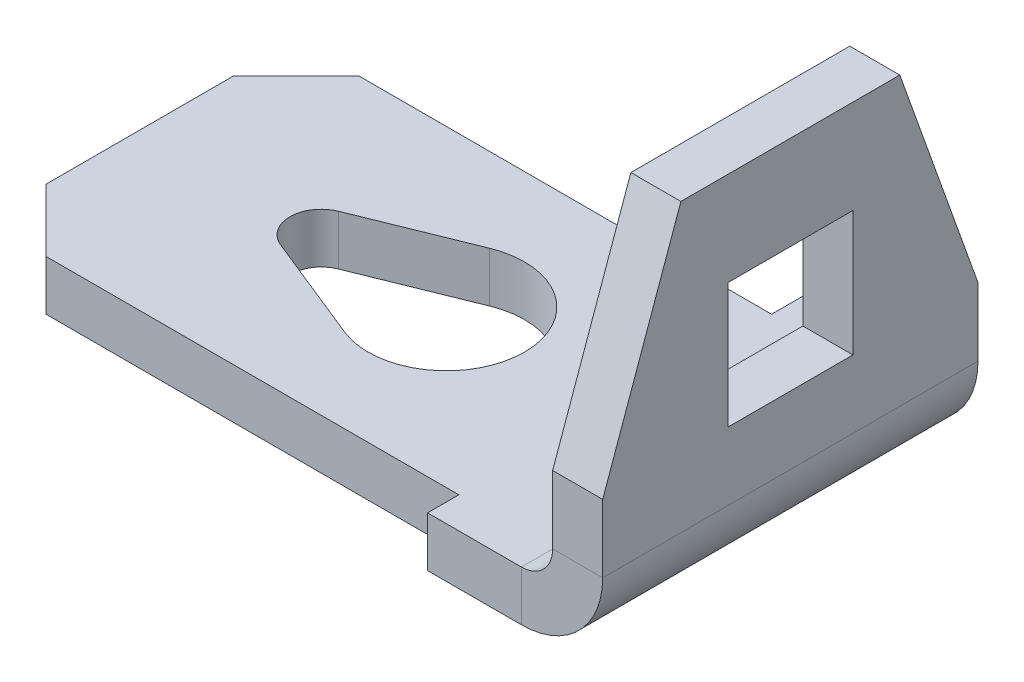
ISO-10303-21;
HEADER;
FILE_DESCRIPTION(('STEP AP214'),'2;1');
FILE_NAME('part.step','',(''),(''),'','','');
FILE_SCHEMA(('AUTOMOTIVE_DESIGN { 1 0 10303 214 1 1 1 1 }'));
ENDSEC;
DATA;
#1=APPLICATION_CONTEXT('core data for automotive mechanical design processes');
#2=APPLICATION_PROTOCOL_DEFINITION('international standard','automotive_design',2000,#1);
#3=PRODUCT_CONTEXT('',#1,'mechanical');
#4=PRODUCT('Part','Part','',(#3));
#5=PRODUCT_RELATED_PRODUCT_CATEGORY('part','',(#4));
#6=PRODUCT_DEFINITION_FORMATION('','',#4);
#7=PRODUCT_DEFINITION_CONTEXT('part definition',#1,'design');
#8=PRODUCT_DEFINITION('design','',#6,#7);
#9=PRODUCT_DEFINITION_SHAPE('','',#8);
#10=(LENGTH_UNIT() NAMED_UNIT(*) SI_UNIT(.MILLI.,.METRE.));
#11=(NAMED_UNIT(*) PLANE_ANGLE_UNIT() SI_UNIT($,.RADIAN.));
#12=(NAMED_UNIT(*) SI_UNIT($,.STERADIAN.) SOLID_ANGLE_UNIT());
#13=UNCERTAINTY_MEASURE_WITH_UNIT(LENGTH_MEASURE(1.E-05),#10,'distance_accuracy_value','');
#14=(GEOMETRIC_REPRESENTATION_CONTEXT(3) GLOBAL_UNCERTAINTY_ASSIGNED_CONTEXT((#13)) GLOBAL_UNIT_ASSIGNED_CONTEXT((#10,
#11,#12)) REPRESENTATION_CONTEXT('',''));
#15=CARTESIAN_POINT('',(0.,0.,0.));
#16=DIRECTION('',(0.,0.,1.));
#17=DIRECTION('',(1.,0.,0.));
#18=AXIS2_PLACEMENT_3D('',#15,#16,#17);
#19=CARTESIAN_POINT('',(-2.2,2.58628330588459,0.));
#20=DIRECTION('',(-1.,0.,0.));
#21=DIRECTION('',(0.,0.,1.));
#22=AXIS2_PLACEMENT_3D('',#19,#20,#21);
#23=PLANE('',#22);
#24=DIRECTION('',(0.,1.,0.));
#25=VECTOR('',#24,1.);
#26=CARTESIAN_POINT('',(-2.2,1.58628330588459,1.));
#27=LINE('',#26,#25);
#28=CARTESIAN_POINT('',(-2.2,1.58628330588459,1.));
#29=VERTEX_POINT('',#28);
#30=CARTESIAN_POINT('',(-2.20000000000001,3.58628330588459,1.));
#31=VERTEX_POINT('',#30);
#32=EDGE_CURVE('E275',#29,#31,#27,.T.);
#33=ORIENTED_EDGE('',*,*,#32,.T.);
#34=DIRECTION('',(0.,0.,-1.));
#35=VECTOR('',#34,1.);
#36=CARTESIAN_POINT('',(-2.20000000000001,3.58628330588459,1.));
#37=LINE('',#36,#35);
#38=CARTESIAN_POINT('',(-2.20000000000001,3.58628330588459,-1.));
#39=VERTEX_POINT('',#38);
#40=EDGE_CURVE('E284',#31,#39,#37,.T.);
#41=ORIENTED_EDGE('',*,*,#40,.T.);
#42=DIRECTION('',(0.,-1.,0.));
#43=VECTOR('',#42,1.);
#44=CARTESIAN_POINT('',(-2.2,1.58628330588459,-1.));
#45=LINE('',#44,#43);
#46=CARTESIAN_POINT('',(-2.2,1.58628330588459,-1.));
#47=VERTEX_POINT('',#46);
#48=EDGE_CURVE('E297',#39,#47,#45,.T.);
#49=ORIENTED_EDGE('',*,*,#48,.T.);
#50=DIRECTION('',(0.,0.,1.));
#51=VECTOR('',#50,1.);
#52=CARTESIAN_POINT('',(-2.2,1.58628330588459,1.));
#53=LINE('',#52,#51);
#54=EDGE_CURVE('E66',#47,#29,#53,.T.);
#55=ORIENTED_EDGE('',*,*,#54,.T.);
#56=EDGE_LOOP('',(#33,#41,#49,#55));
#57=FACE_BOUND('',#56,.T.);
#58=DIRECTION('',(0.,1.,0.));
#59=VECTOR('',#58,1.);
#60=CARTESIAN_POINT('',(-2.2,1.58628330588459,3.));
#61=LINE('',#60,#59);
#62=CARTESIAN_POINT('',(-2.2,0.500000000000005,3.));
#63=VERTEX_POINT('',#62);
#64=CARTESIAN_POINT('',(-2.2,1.58628330588459,3.));
#65=VERTEX_POINT('',#64);
#66=EDGE_CURVE('E46',#63,#65,#61,.T.);
#67=ORIENTED_EDGE('',*,*,#66,.F.);
#68=DIRECTION('',(0.,0.,-1.));
#69=VECTOR('',#68,1.);
#70=CARTESIAN_POINT('',(-2.2,0.500000000000004,0.));
#71=LINE('',#70,#69);
#72=CARTESIAN_POINT('',(-2.2,0.500000000000004,-3.));
#73=VERTEX_POINT('',#72);
#74=EDGE_CURVE('E203',#63,#73,#71,.T.);
#75=ORIENTED_EDGE('',*,*,#74,.T.);
#76=DIRECTION('',(0.,-1.,0.));
#77=VECTOR('',#76,1.);
#78=CARTESIAN_POINT('',(-2.2,1.58628330588459,-3.));
#79=LINE('',#78,#77);
#80=CARTESIAN_POINT('',(-2.2,1.58628330588459,-3.));
#81=VERTEX_POINT('',#80);
#82=EDGE_CURVE('E230',#81,#73,#79,.T.);
#83=ORIENTED_EDGE('',*,*,#82,.F.);
#84=DIRECTION('',(0.,-0.941741911594837,-0.336336396998156));
#85=VECTOR('',#84,1.);
#86=CARTESIAN_POINT('',(-2.20000000000001,5.08628330588459,-1.75));
#87=LINE('',#86,#85);
#88=CARTESIAN_POINT('',(-2.20000000000001,5.08628330588459,-1.75));
#89=VERTEX_POINT('',#88);
#90=EDGE_CURVE('E240',#89,#81,#87,.T.);
#91=ORIENTED_EDGE('',*,*,#90,.F.);
#92=DIRECTION('',(0.,0.,-1.));
#93=VECTOR('',#92,1.);
#94=CARTESIAN_POINT('',(-2.20000000000001,5.08628330588459,1.75));
#95=LINE('',#94,#93);
#96=CARTESIAN_POINT('',(-2.20000000000001,5.08628330588459,1.75));
#97=VERTEX_POINT('',#96);
#98=EDGE_CURVE('E261',#97,#89,#95,.T.);
#99=ORIENTED_EDGE('',*,*,#98,.F.);
#100=DIRECTION('',(0.,0.941741911594837,-0.336336396998156));
#101=VECTOR('',#100,1.);
#102=CARTESIAN_POINT('',(-2.20000000000001,5.08628330588459,1.75));
#103=LINE('',#102,#101);
#104=EDGE_CURVE('E226',#65,#97,#103,.T.);
#105=ORIENTED_EDGE('',*,*,#104,.F.);
#106=EDGE_LOOP('',(#67,#75,#83,#91,#99,#105));
#107=FACE_BOUND('',#106,.T.);
#108=ADVANCED_FACE('F42',(#57,#107),#23,.F.);
#109=CARTESIAN_POINT('',(-2.20000000000001,5.08628330588459,-1.75));
#110=DIRECTION('',(0.,0.336336396998156,-0.941741911594837));
#111=DIRECTION('',(0.,-0.941741911594838,-0.336336396998156));
#112=AXIS2_PLACEMENT_3D('',#109,#110,#111);
#113=PLANE('',#112);
#114=DIRECTION('',(0.,-0.941741911594837,-0.336336396998156));
#115=VECTOR('',#114,1.);
#116=CARTESIAN_POINT('',(-3.00000000000001,5.08628330588459,-1.75));
#117=LINE('',#116,#115);
#118=CARTESIAN_POINT('',(-3.00000000000001,5.08628330588459,-1.75));
#119=VERTEX_POINT('',#118);
#120=CARTESIAN_POINT('',(-3.,1.58628330588459,-3.));
#121=VERTEX_POINT('',#120);
#122=EDGE_CURVE('E243',#119,#121,#117,.T.);
#123=ORIENTED_EDGE('',*,*,#122,.F.);
#124=DIRECTION('',(-1.,0.,0.));
#125=VECTOR('',#124,1.);
#126=CARTESIAN_POINT('',(-2.20000000000001,5.08628330588459,-1.75));
#127=LINE('',#126,#125);
#128=EDGE_CURVE('E213',#89,#119,#127,.T.);
#129=ORIENTED_EDGE('',*,*,#128,.F.);
#130=ORIENTED_EDGE('',*,*,#90,.T.);
#131=DIRECTION('',(-1.,0.,0.));
#132=VECTOR('',#131,1.);
#133=CARTESIAN_POINT('',(-2.2,1.58628330588459,-3.));
#134=LINE('',#133,#132);
#135=EDGE_CURVE('E260',#81,#121,#134,.T.);
#136=ORIENTED_EDGE('',*,*,#135,.T.);
#137=EDGE_LOOP('',(#123,#129,#130,#136));
#138=FACE_BOUND('',#137,.T.);
#139=ADVANCED_FACE('F467',(#138),#113,.T.);
#140=CARTESIAN_POINT('',(-2.20000000000001,5.08628330588459,1.75));
#141=DIRECTION('',(0.,1.,0.));
#142=DIRECTION('',(0.,0.,-1.));
#143=AXIS2_PLACEMENT_3D('',#140,#141,#142);
#144=PLANE('',#143);
#145=DIRECTION('',(0.,0.,-1.));
#146=VECTOR('',#145,1.);
#147=CARTESIAN_POINT('',(-3.00000000000001,5.08628330588459,1.75));
#148=LINE('',#147,#146);
#149=CARTESIAN_POINT('',(-3.00000000000001,5.08628330588459,1.75));
#150=VERTEX_POINT('',#149);
#151=EDGE_CURVE('E247',#150,#119,#148,.T.);
#152=ORIENTED_EDGE('',*,*,#151,.F.);
#153=DIRECTION('',(-1.,0.,0.));
#154=VECTOR('',#153,1.);
#155=CARTESIAN_POINT('',(-2.20000000000001,5.08628330588459,1.75));
#156=LINE('',#155,#154);
#157=EDGE_CURVE('E257',#97,#150,#156,.T.);
#158=ORIENTED_EDGE('',*,*,#157,.F.);
#159=ORIENTED_EDGE('',*,*,#98,.T.);
#160=ORIENTED_EDGE('',*,*,#128,.T.);
#161=EDGE_LOOP('',(#152,#158,#159,#160));
#162=FACE_BOUND('',#161,.T.);
#163=ADVANCED_FACE('F468',(#162),#144,.T.);
#164=CARTESIAN_POINT('',(-2.20000000000001,5.08628330588459,1.75));
#165=DIRECTION('',(0.,0.336336396998156,0.941741911594837));
#166=DIRECTION('',(0.,0.941741911594838,-0.336336396998156));
#167=AXIS2_PLACEMENT_3D('',#164,#165,#166);
#168=PLANE('',#167);
#169=DIRECTION('',(0.,0.941741911594837,-0.336336396998156));
#170=VECTOR('',#169,1.);
#171=CARTESIAN_POINT('',(-3.00000000000001,5.08628330588459,1.75));
#172=LINE('',#171,#170);
#173=CARTESIAN_POINT('',(-3.,1.58628330588459,3.));
#174=VERTEX_POINT('',#173);
#175=EDGE_CURVE('E244',#174,#150,#172,.T.);
#176=ORIENTED_EDGE('',*,*,#175,.F.);
#177=DIRECTION('',(-1.,0.,0.));
#178=VECTOR('',#177,1.);
#179=CARTESIAN_POINT('',(-2.2,1.58628330588459,3.));
#180=LINE('',#179,#178);
#181=EDGE_CURVE('E259',#65,#174,#180,.T.);
#182=ORIENTED_EDGE('',*,*,#181,.F.);
#183=ORIENTED_EDGE('',*,*,#104,.T.);
#184=ORIENTED_EDGE('',*,*,#157,.T.);
#185=EDGE_LOOP('',(#176,#182,#183,#184));
#186=FACE_BOUND('',#185,.T.);
#187=ADVANCED_FACE('F505',(#186),#168,.T.);
#188=CARTESIAN_POINT('',(-2.2,1.58628330588459,3.));
#189=DIRECTION('',(0.,0.,1.));
#190=DIRECTION('',(0.,1.,0.));
#191=AXIS2_PLACEMENT_3D('',#188,#189,#190);
#192=PLANE('',#191);
#193=DIRECTION('',(-1.,0.,0.));
#194=VECTOR('',#193,1.);
#195=CARTESIAN_POINT('',(-2.2,0.500000000000004,3.));
#196=LINE('',#195,#194);
#197=CARTESIAN_POINT('',(-3.,0.500000000000002,3.));
#198=VERTEX_POINT('',#197);
#199=EDGE_CURVE('E212',#63,#198,#196,.T.);
#200=ORIENTED_EDGE('',*,*,#199,.F.);
#201=ORIENTED_EDGE('',*,*,#66,.T.);
#202=ORIENTED_EDGE('',*,*,#181,.T.);
#203=DIRECTION('',(0.,1.,0.));
#204=VECTOR('',#203,1.);
#205=CARTESIAN_POINT('',(-3.,1.58628330588459,3.));
#206=LINE('',#205,#204);
#207=EDGE_CURVE('E233',#198,#174,#206,.T.);
#208=ORIENTED_EDGE('',*,*,#207,.F.);
#209=EDGE_LOOP('',(#200,#201,#202,#208));
#210=FACE_BOUND('',#209,.T.);
#211=ADVANCED_FACE('F232',(#210),#192,.T.);
#212=CARTESIAN_POINT('',(-2.2,1.58628330588459,-3.));
#213=DIRECTION('',(0.,0.,-1.));
#214=DIRECTION('',(0.,-1.,0.));
#215=AXIS2_PLACEMENT_3D('',#212,#213,#214);
#216=PLANE('',#215);
#217=DIRECTION('',(1.,0.,0.));
#218=VECTOR('',#217,1.);
#219=CARTESIAN_POINT('',(-2.2,0.500000000000004,-3.));
#220=LINE('',#219,#218);
#221=CARTESIAN_POINT('',(-3.,0.500000000000002,-3.));
#222=VERTEX_POINT('',#221);
#223=EDGE_CURVE('E12',#222,#73,#220,.T.);
#224=ORIENTED_EDGE('',*,*,#223,.F.);
#225=DIRECTION('',(0.,-1.,0.));
#226=VECTOR('',#225,1.);
#227=CARTESIAN_POINT('',(-3.,1.58628330588459,-3.));
#228=LINE('',#227,#226);
#229=EDGE_CURVE('E241',#121,#222,#228,.T.);
#230=ORIENTED_EDGE('',*,*,#229,.F.);
#231=ORIENTED_EDGE('',*,*,#135,.F.);
#232=ORIENTED_EDGE('',*,*,#82,.T.);
#233=EDGE_LOOP('',(#224,#230,#231,#232));
#234=FACE_BOUND('',#233,.T.);
#235=ADVANCED_FACE('F44',(#234),#216,.T.);
#236=CARTESIAN_POINT('',(-3.,2.58628330588459,0.));
#237=DIRECTION('',(-1.,0.,0.));
#238=DIRECTION('',(0.,0.,1.));
#239=AXIS2_PLACEMENT_3D('',#236,#237,#238);
#240=PLANE('',#239);
#241=DIRECTION('',(0.,0.,-1.));
#242=VECTOR('',#241,1.);
#243=CARTESIAN_POINT('',(-3.,0.500000000000002,0.));
#244=LINE('',#243,#242);
#245=EDGE_CURVE('E51',#198,#222,#244,.T.);
#246=ORIENTED_EDGE('',*,*,#245,.F.);
#247=ORIENTED_EDGE('',*,*,#207,.T.);
#248=ORIENTED_EDGE('',*,*,#175,.T.);
#249=ORIENTED_EDGE('',*,*,#151,.T.);
#250=ORIENTED_EDGE('',*,*,#122,.T.);
#251=ORIENTED_EDGE('',*,*,#229,.T.);
#252=EDGE_LOOP('',(#246,#247,#248,#249,#250,#251));
#253=FACE_BOUND('',#252,.T.);
#254=DIRECTION('',(0.,0.,-1.));
#255=VECTOR('',#254,1.);
#256=CARTESIAN_POINT('',(-3.00000000000001,3.58628330588459,1.));
#257=LINE('',#256,#255);
#258=CARTESIAN_POINT('',(-3.00000000000001,3.58628330588459,1.));
#259=VERTEX_POINT('',#258);
#260=CARTESIAN_POINT('',(-3.00000000000001,3.58628330588459,-1.));
#261=VERTEX_POINT('',#260);
#262=EDGE_CURVE('E291',#259,#261,#257,.T.);
#263=ORIENTED_EDGE('',*,*,#262,.F.);
#264=DIRECTION('',(0.,1.,0.));
#265=VECTOR('',#264,1.);
#266=CARTESIAN_POINT('',(-3.,1.58628330588459,1.));
#267=LINE('',#266,#265);
#268=CARTESIAN_POINT('',(-3.,1.58628330588459,1.));
#269=VERTEX_POINT('',#268);
#270=EDGE_CURVE('E281',#269,#259,#267,.T.);
#271=ORIENTED_EDGE('',*,*,#270,.F.);
#272=DIRECTION('',(0.,0.,1.));
#273=VECTOR('',#272,1.);
#274=CARTESIAN_POINT('',(-3.,1.58628330588459,1.));
#275=LINE('',#274,#273);
#276=CARTESIAN_POINT('',(-3.,1.58628330588459,-1.));
#277=VERTEX_POINT('',#276);
#278=EDGE_CURVE('E285',#277,#269,#275,.T.);
#279=ORIENTED_EDGE('',*,*,#278,.F.);
#280=DIRECTION('',(0.,-1.,0.));
#281=VECTOR('',#280,1.);
#282=CARTESIAN_POINT('',(-3.,1.58628330588459,-1.));
#283=LINE('',#282,#281);
#284=EDGE_CURVE('E288',#261,#277,#283,.T.);
#285=ORIENTED_EDGE('',*,*,#284,.F.);
#286=EDGE_LOOP('',(#263,#271,#279,#285));
#287=FACE_BOUND('',#286,.T.);
#288=ADVANCED_FACE('F469',(#253,#287),#240,.T.);
#289=CARTESIAN_POINT('',(-2.20000000000001,3.58628330588459,1.));
#290=DIRECTION('',(0.,1.,0.));
#291=DIRECTION('',(0.,0.,-1.));
#292=AXIS2_PLACEMENT_3D('',#289,#290,#291);
#293=PLANE('',#292);
#294=ORIENTED_EDGE('',*,*,#262,.T.);
#295=DIRECTION('',(-1.,0.,0.));
#296=VECTOR('',#295,1.);
#297=CARTESIAN_POINT('',(-2.20000000000001,3.58628330588459,-1.));
#298=LINE('',#297,#296);
#299=EDGE_CURVE('E271',#39,#261,#298,.T.);
#300=ORIENTED_EDGE('',*,*,#299,.F.);
#301=ORIENTED_EDGE('',*,*,#40,.F.);
#302=DIRECTION('',(-1.,0.,0.));
#303=VECTOR('',#302,1.);
#304=CARTESIAN_POINT('',(-2.20000000000001,3.58628330588459,1.));
#305=LINE('',#304,#303);
#306=EDGE_CURVE('E279',#31,#259,#305,.T.);
#307=ORIENTED_EDGE('',*,*,#306,.T.);
#308=EDGE_LOOP('',(#294,#300,#301,#307));
#309=FACE_BOUND('',#308,.T.);
#310=ADVANCED_FACE('F472',(#309),#293,.F.);
#311=CARTESIAN_POINT('',(-2.2,1.58628330588459,1.));
#312=DIRECTION('',(0.,0.,1.));
#313=DIRECTION('',(0.,1.,0.));
#314=AXIS2_PLACEMENT_3D('',#311,#312,#313);
#315=PLANE('',#314);
#316=ORIENTED_EDGE('',*,*,#270,.T.);
#317=ORIENTED_EDGE('',*,*,#306,.F.);
#318=ORIENTED_EDGE('',*,*,#32,.F.);
#319=DIRECTION('',(-1.,0.,0.));
#320=VECTOR('',#319,1.);
#321=CARTESIAN_POINT('',(-2.2,1.58628330588459,1.));
#322=LINE('',#321,#320);
#323=EDGE_CURVE('E277',#29,#269,#322,.T.);
#324=ORIENTED_EDGE('',*,*,#323,.T.);
#325=EDGE_LOOP('',(#316,#317,#318,#324));
#326=FACE_BOUND('',#325,.T.);
#327=ADVANCED_FACE('F485',(#326),#315,.F.);
#328=CARTESIAN_POINT('',(-2.2,1.58628330588459,1.));
#329=DIRECTION('',(0.,-1.,0.));
#330=DIRECTION('',(0.,0.,1.));
#331=AXIS2_PLACEMENT_3D('',#328,#329,#330);
#332=PLANE('',#331);
#333=ORIENTED_EDGE('',*,*,#278,.T.);
#334=ORIENTED_EDGE('',*,*,#323,.F.);
#335=ORIENTED_EDGE('',*,*,#54,.F.);
#336=DIRECTION('',(-1.,0.,0.));
#337=VECTOR('',#336,1.);
#338=CARTESIAN_POINT('',(-2.2,1.58628330588459,-1.));
#339=LINE('',#338,#337);
#340=EDGE_CURVE('E274',#47,#277,#339,.T.);
#341=ORIENTED_EDGE('',*,*,#340,.T.);
#342=EDGE_LOOP('',(#333,#334,#335,#341));
#343=FACE_BOUND('',#342,.T.);
#344=ADVANCED_FACE('F486',(#343),#332,.F.);
#345=CARTESIAN_POINT('',(-2.2,1.58628330588459,-1.));
#346=DIRECTION('',(0.,0.,-1.));
#347=DIRECTION('',(0.,-1.,0.));
#348=AXIS2_PLACEMENT_3D('',#345,#346,#347);
#349=PLANE('',#348);
#350=ORIENTED_EDGE('',*,*,#284,.T.);
#351=ORIENTED_EDGE('',*,*,#340,.F.);
#352=ORIENTED_EDGE('',*,*,#48,.F.);
#353=ORIENTED_EDGE('',*,*,#299,.T.);
#354=EDGE_LOOP('',(#350,#351,#352,#353));
#355=FACE_BOUND('',#354,.T.);
#356=ADVANCED_FACE('F481',(#355),#349,.F.);
#357=CARTESIAN_POINT('',(-7.7,-0.8,0.));
#358=DIRECTION('',(0.,1.,0.));
#359=DIRECTION('',(0.,0.,1.));
#360=AXIS2_PLACEMENT_3D('',#357,#358,#359);
#361=CYLINDRICAL_SURFACE('',#360,1.25);
#362=CARTESIAN_POINT('',(-7.7,0.,0.));
#363=DIRECTION('',(0.,1.,0.));
#364=DIRECTION('',(0.,0.,1.));
#365=AXIS2_PLACEMENT_3D('',#362,#363,#364);
#366=CIRCLE('',#365,1.25);
#367=CARTESIAN_POINT('',(-8.16875,0.,1.1587810136087));
#368=VERTEX_POINT('',#367);
#369=CARTESIAN_POINT('',(-8.16875,0.,-1.1587810136087));
#370=VERTEX_POINT('',#369);
#371=EDGE_CURVE('E304',#368,#370,#366,.T.);
#372=ORIENTED_EDGE('',*,*,#371,.T.);
#373=DIRECTION('',(0.,1.,0.));
#374=VECTOR('',#373,1.);
#375=CARTESIAN_POINT('',(-8.16875,-0.8,-1.1587810136087));
#376=LINE('',#375,#374);
#377=CARTESIAN_POINT('',(-8.16875,-0.8,-1.1587810136087));
#378=VERTEX_POINT('',#377);
#379=EDGE_CURVE('E322',#378,#370,#376,.T.);
#380=ORIENTED_EDGE('',*,*,#379,.F.);
#381=CARTESIAN_POINT('',(-7.7,-0.8,0.));
#382=DIRECTION('',(0.,1.,0.));
#383=DIRECTION('',(0.,0.,1.));
#384=AXIS2_PLACEMENT_3D('',#381,#382,#383);
#385=CIRCLE('',#384,1.25);
#386=CARTESIAN_POINT('',(-8.16875,-0.8,1.1587810136087));
#387=VERTEX_POINT('',#386);
#388=EDGE_CURVE('E368',#387,#378,#385,.T.);
#389=ORIENTED_EDGE('',*,*,#388,.F.);
#390=DIRECTION('',(0.,1.,0.));
#391=VECTOR('',#390,1.);
#392=CARTESIAN_POINT('',(-8.16875,-0.8,1.1587810136087));
#393=LINE('',#392,#391);
#394=EDGE_CURVE('E307',#387,#368,#393,.T.);
#395=ORIENTED_EDGE('',*,*,#394,.T.);
#396=EDGE_LOOP('',(#372,#380,#389,#395));
#397=FACE_BOUND('',#396,.T.);
#398=ADVANCED_FACE('F493',(#397),#361,.F.);
#399=CARTESIAN_POINT('',(-9.8875,-0.8,0.463512405443479));
#400=DIRECTION('',(-0.375,0.,0.927024810886958));
#401=DIRECTION('',(0.927024810886958,0.,0.375));
#402=AXIS2_PLACEMENT_3D('',#399,#400,#401);
#403=PLANE('',#402);
#404=DIRECTION('',(0.927024810886958,0.,0.375));
#405=VECTOR('',#404,1.);
#406=CARTESIAN_POINT('',(-9.8875,0.,0.463512405443479));
#407=LINE('',#406,#405);
#408=CARTESIAN_POINT('',(-9.8875,0.,0.463512405443478));
#409=VERTEX_POINT('',#408);
#410=EDGE_CURVE('E309',#409,#368,#407,.T.);
#411=ORIENTED_EDGE('',*,*,#410,.T.);
#412=ORIENTED_EDGE('',*,*,#394,.F.);
#413=DIRECTION('',(0.927024810886958,0.,0.375));
#414=VECTOR('',#413,1.);
#415=CARTESIAN_POINT('',(-9.8875,-0.8,0.463512405443479));
#416=LINE('',#415,#414);
#417=CARTESIAN_POINT('',(-9.8875,-0.8,0.463512405443479));
#418=VERTEX_POINT('',#417);
#419=EDGE_CURVE('E365',#418,#387,#416,.T.);
#420=ORIENTED_EDGE('',*,*,#419,.F.);
#421=DIRECTION('',(0.,1.,0.));
#422=VECTOR('',#421,1.);
#423=CARTESIAN_POINT('',(-9.8875,-0.8,0.463512405443479));
#424=LINE('',#423,#422);
#425=EDGE_CURVE('E312',#418,#409,#424,.T.);
#426=ORIENTED_EDGE('',*,*,#425,.T.);
#427=EDGE_LOOP('',(#411,#412,#420,#426));
#428=FACE_BOUND('',#427,.T.);
#429=ADVANCED_FACE('F547',(#428),#403,.F.);
#430=CARTESIAN_POINT('',(-9.7,-0.8,0.));
#431=DIRECTION('',(0.,1.,0.));
#432=DIRECTION('',(0.,0.,1.));
#433=AXIS2_PLACEMENT_3D('',#430,#431,#432);
#434=CYLINDRICAL_SURFACE('',#433,0.5);
#435=CARTESIAN_POINT('',(-9.7,0.,0.));
#436=DIRECTION('',(0.,1.,0.));
#437=DIRECTION('',(0.,0.,1.));
#438=AXIS2_PLACEMENT_3D('',#435,#436,#437);
#439=CIRCLE('',#438,0.5);
#440=CARTESIAN_POINT('',(-9.8875,0.,-0.463512405443479));
#441=VERTEX_POINT('',#440);
#442=EDGE_CURVE('E315',#441,#409,#439,.T.);
#443=ORIENTED_EDGE('',*,*,#442,.T.);
#444=ORIENTED_EDGE('',*,*,#425,.F.);
#445=CARTESIAN_POINT('',(-9.7,-0.8,0.));
#446=DIRECTION('',(0.,1.,0.));
#447=DIRECTION('',(0.,0.,1.));
#448=AXIS2_PLACEMENT_3D('',#445,#446,#447);
#449=CIRCLE('',#448,0.5);
#450=CARTESIAN_POINT('',(-9.8875,-0.8,-0.463512405443479));
#451=VERTEX_POINT('',#450);
#452=EDGE_CURVE('E362',#451,#418,#449,.T.);
#453=ORIENTED_EDGE('',*,*,#452,.F.);
#454=DIRECTION('',(0.,1.,0.));
#455=VECTOR('',#454,1.);
#456=CARTESIAN_POINT('',(-9.8875,-0.8,-0.463512405443479));
#457=LINE('',#456,#455);
#458=EDGE_CURVE('E317',#451,#441,#457,.T.);
#459=ORIENTED_EDGE('',*,*,#458,.T.);
#460=EDGE_LOOP('',(#443,#444,#453,#459));
#461=FACE_BOUND('',#460,.T.);
#462=ADVANCED_FACE('F558',(#461),#434,.F.);
#463=CARTESIAN_POINT('',(-9.8875,-0.8,-0.463512405443479));
#464=DIRECTION('',(-0.375,0.,-0.927024810886958));
#465=DIRECTION('',(-0.927024810886958,0.,0.375));
#466=AXIS2_PLACEMENT_3D('',#463,#464,#465);
#467=PLANE('',#466);
#468=DIRECTION('',(-0.927024810886958,0.,0.375));
#469=VECTOR('',#468,1.);
#470=CARTESIAN_POINT('',(-9.8875,0.,-0.463512405443479));
#471=LINE('',#470,#469);
#472=EDGE_CURVE('E319',#370,#441,#471,.T.);
#473=ORIENTED_EDGE('',*,*,#472,.T.);
#474=ORIENTED_EDGE('',*,*,#458,.F.);
#475=DIRECTION('',(-0.927024810886958,0.,0.375));
#476=VECTOR('',#475,1.);
#477=CARTESIAN_POINT('',(-9.8875,-0.8,-0.463512405443479));
#478=LINE('',#477,#476);
#479=EDGE_CURVE('E359',#378,#451,#478,.T.);
#480=ORIENTED_EDGE('',*,*,#479,.F.);
#481=ORIENTED_EDGE('',*,*,#379,.T.);
#482=EDGE_LOOP('',(#473,#474,#480,#481));
#483=FACE_BOUND('',#482,.T.);
#484=ADVANCED_FACE('F569',(#483),#467,.F.);
#485=CARTESIAN_POINT('',(-5.,-0.8,-3.));
#486=DIRECTION('',(-1.,0.,0.));
#487=DIRECTION('',(0.,0.,1.));
#488=AXIS2_PLACEMENT_3D('',#485,#486,#487);
#489=PLANE('',#488);
#490=DIRECTION('',(0.,0.,1.));
#491=VECTOR('',#490,1.);
#492=CARTESIAN_POINT('',(-5.,0.,-3.));
#493=LINE('',#492,#491);
#494=CARTESIAN_POINT('',(-5.,0.,-3.));
#495=VERTEX_POINT('',#494);
#496=CARTESIAN_POINT('',(-5.,0.,-2.5));
#497=VERTEX_POINT('',#496);
#498=EDGE_CURVE('E383',#495,#497,#493,.T.);
#499=ORIENTED_EDGE('',*,*,#498,.F.);
#500=DIRECTION('',(0.,1.,0.));
#501=VECTOR('',#500,1.);
#502=CARTESIAN_POINT('',(-5.,-0.8,-3.));
#503=LINE('',#502,#501);
#504=CARTESIAN_POINT('',(-5.,-0.8,-3.));
#505=VERTEX_POINT('',#504);
#506=EDGE_CURVE('E293',#505,#495,#503,.T.);
#507=ORIENTED_EDGE('',*,*,#506,.F.);
#508=DIRECTION('',(0.,0.,1.));
#509=VECTOR('',#508,1.);
#510=CARTESIAN_POINT('',(-5.,-0.8,-3.));
#511=LINE('',#510,#509);
#512=CARTESIAN_POINT('',(-5.,-0.8,-2.5));
#513=VERTEX_POINT('',#512);
#514=EDGE_CURVE('E324',#505,#513,#511,.T.);
#515=ORIENTED_EDGE('',*,*,#514,.T.);
#516=DIRECTION('',(0.,1.,0.));
#517=VECTOR('',#516,1.);
#518=CARTESIAN_POINT('',(-5.,-0.8,-2.5));
#519=LINE('',#518,#517);
#520=EDGE_CURVE('E327',#513,#497,#519,.T.);
#521=ORIENTED_EDGE('',*,*,#520,.T.);
#522=EDGE_LOOP('',(#499,#507,#515,#521));
#523=FACE_BOUND('',#522,.T.);
#524=ADVANCED_FACE('F458',(#523),#489,.T.);
#525=CARTESIAN_POINT('',(-5.,-0.8,-2.5));
#526=DIRECTION('',(0.,0.,-1.));
#527=DIRECTION('',(-1.,0.,0.));
#528=AXIS2_PLACEMENT_3D('',#525,#526,#527);
#529=PLANE('',#528);
#530=DIRECTION('',(-1.,0.,0.));
#531=VECTOR('',#530,1.);
#532=CARTESIAN_POINT('',(-5.,0.,-2.5));
#533=LINE('',#532,#531);
#534=CARTESIAN_POINT('',(-11.6,0.,-2.5));
#535=VERTEX_POINT('',#534);
#536=EDGE_CURVE('E386',#497,#535,#533,.T.);
#537=ORIENTED_EDGE('',*,*,#536,.F.);
#538=ORIENTED_EDGE('',*,*,#520,.F.);
#539=DIRECTION('',(-1.,0.,0.));
#540=VECTOR('',#539,1.);
#541=CARTESIAN_POINT('',(-5.,-0.8,-2.5));
#542=LINE('',#541,#540);
#543=CARTESIAN_POINT('',(-11.6,-0.8,-2.5));
#544=VERTEX_POINT('',#543);
#545=EDGE_CURVE('E329',#513,#544,#542,.T.);
#546=ORIENTED_EDGE('',*,*,#545,.T.);
#547=DIRECTION('',(0.,1.,0.));
#548=VECTOR('',#547,1.);
#549=CARTESIAN_POINT('',(-11.6,-0.8,-2.5));
#550=LINE('',#549,#548);
#551=EDGE_CURVE('E332',#544,#535,#550,.T.);
#552=ORIENTED_EDGE('',*,*,#551,.T.);
#553=EDGE_LOOP('',(#537,#538,#546,#552));
#554=FACE_BOUND('',#553,.T.);
#555=ADVANCED_FACE('F453',(#554),#529,.T.);
#556=CARTESIAN_POINT('',(-11.6,-0.8,-2.5));
#557=DIRECTION('',(-0.707106781186547,0.,-0.707106781186548));
#558=DIRECTION('',(-0.707106781186548,0.,0.707106781186547));
#559=AXIS2_PLACEMENT_3D('',#556,#557,#558);
#560=PLANE('',#559);
#561=DIRECTION('',(-0.707106781186548,0.,0.707106781186547));
#562=VECTOR('',#561,1.);
#563=CARTESIAN_POINT('',(-11.6,0.,-2.5));
#564=LINE('',#563,#562);
#565=CARTESIAN_POINT('',(-12.6,0.,-1.5));
#566=VERTEX_POINT('',#565);
#567=EDGE_CURVE('E389',#535,#566,#564,.T.);
#568=ORIENTED_EDGE('',*,*,#567,.F.);
#569=ORIENTED_EDGE('',*,*,#551,.F.);
#570=DIRECTION('',(-0.707106781186548,0.,0.707106781186547));
#571=VECTOR('',#570,1.);
#572=CARTESIAN_POINT('',(-11.6,-0.8,-2.5));
#573=LINE('',#572,#571);
#574=CARTESIAN_POINT('',(-12.6,-0.8,-1.5));
#575=VERTEX_POINT('',#574);
#576=EDGE_CURVE('E334',#544,#575,#573,.T.);
#577=ORIENTED_EDGE('',*,*,#576,.T.);
#578=DIRECTION('',(0.,1.,0.));
#579=VECTOR('',#578,1.);
#580=CARTESIAN_POINT('',(-12.6,-0.8,-1.5));
#581=LINE('',#580,#579);
#582=EDGE_CURVE('E337',#575,#566,#581,.T.);
#583=ORIENTED_EDGE('',*,*,#582,.T.);
#584=EDGE_LOOP('',(#568,#569,#577,#583));
#585=FACE_BOUND('',#584,.T.);
#586=ADVANCED_FACE('F450',(#585),#560,.T.);
#587=CARTESIAN_POINT('',(-12.6,-0.8,-1.5));
#588=DIRECTION('',(-1.,0.,0.));
#589=DIRECTION('',(0.,0.,1.));
#590=AXIS2_PLACEMENT_3D('',#587,#588,#589);
#591=PLANE('',#590);
#592=DIRECTION('',(0.,0.,1.));
#593=VECTOR('',#592,1.);
#594=CARTESIAN_POINT('',(-12.6,0.,-1.5));
#595=LINE('',#594,#593);
#596=CARTESIAN_POINT('',(-12.6,0.,1.5));
#597=VERTEX_POINT('',#596);
#598=EDGE_CURVE('E392',#566,#597,#595,.T.);
#599=ORIENTED_EDGE('',*,*,#598,.F.);
#600=ORIENTED_EDGE('',*,*,#582,.F.);
#601=DIRECTION('',(0.,0.,1.));
#602=VECTOR('',#601,1.);
#603=CARTESIAN_POINT('',(-12.6,-0.8,-1.5));
#604=LINE('',#603,#602);
#605=CARTESIAN_POINT('',(-12.6,-0.8,1.5));
#606=VERTEX_POINT('',#605);
#607=EDGE_CURVE('E339',#575,#606,#604,.T.);
#608=ORIENTED_EDGE('',*,*,#607,.T.);
#609=DIRECTION('',(0.,1.,0.));
#610=VECTOR('',#609,1.);
#611=CARTESIAN_POINT('',(-12.6,-0.8,1.5));
#612=LINE('',#611,#610);
#613=EDGE_CURVE('E342',#606,#597,#612,.T.);
#614=ORIENTED_EDGE('',*,*,#613,.T.);
#615=EDGE_LOOP('',(#599,#600,#608,#614));
#616=FACE_BOUND('',#615,.T.);
#617=ADVANCED_FACE('F445',(#616),#591,.T.);
#618=CARTESIAN_POINT('',(-11.6,-0.8,2.5));
#619=DIRECTION('',(-0.707106781186547,0.,0.707106781186548));
#620=DIRECTION('',(0.707106781186548,0.,0.707106781186547));
#621=AXIS2_PLACEMENT_3D('',#618,#619,#620);
#622=PLANE('',#621);
#623=DIRECTION('',(0.707106781186548,0.,0.707106781186547));
#624=VECTOR('',#623,1.);
#625=CARTESIAN_POINT('',(-11.6,0.,2.5));
#626=LINE('',#625,#624);
#627=CARTESIAN_POINT('',(-11.6,0.,2.5));
#628=VERTEX_POINT('',#627);
#629=EDGE_CURVE('E395',#597,#628,#626,.T.);
#630=ORIENTED_EDGE('',*,*,#629,.F.);
#631=ORIENTED_EDGE('',*,*,#613,.F.);
#632=DIRECTION('',(0.707106781186548,0.,0.707106781186547));
#633=VECTOR('',#632,1.);
#634=CARTESIAN_POINT('',(-11.6,-0.8,2.5));
#635=LINE('',#634,#633);
#636=CARTESIAN_POINT('',(-11.6,-0.8,2.5));
#637=VERTEX_POINT('',#636);
#638=EDGE_CURVE('E344',#606,#637,#635,.T.);
#639=ORIENTED_EDGE('',*,*,#638,.T.);
#640=DIRECTION('',(0.,1.,0.));
#641=VECTOR('',#640,1.);
#642=CARTESIAN_POINT('',(-11.6,-0.8,2.5));
#643=LINE('',#642,#641);
#644=EDGE_CURVE('E347',#637,#628,#643,.T.);
#645=ORIENTED_EDGE('',*,*,#644,.T.);
#646=EDGE_LOOP('',(#630,#631,#639,#645));
#647=FACE_BOUND('',#646,.T.);
#648=ADVANCED_FACE('F442',(#647),#622,.T.);
#649=CARTESIAN_POINT('',(-5.,-0.8,2.5));
#650=DIRECTION('',(0.,0.,1.));
#651=DIRECTION('',(1.,0.,0.));
#652=AXIS2_PLACEMENT_3D('',#649,#650,#651);
#653=PLANE('',#652);
#654=DIRECTION('',(1.,0.,0.));
#655=VECTOR('',#654,1.);
#656=CARTESIAN_POINT('',(-5.,0.,2.5));
#657=LINE('',#656,#655);
#658=CARTESIAN_POINT('',(-5.,0.,2.5));
#659=VERTEX_POINT('',#658);
#660=EDGE_CURVE('E398',#628,#659,#657,.T.);
#661=ORIENTED_EDGE('',*,*,#660,.F.);
#662=ORIENTED_EDGE('',*,*,#644,.F.);
#663=DIRECTION('',(1.,0.,0.));
#664=VECTOR('',#663,1.);
#665=CARTESIAN_POINT('',(-5.,-0.8,2.5));
#666=LINE('',#665,#664);
#667=CARTESIAN_POINT('',(-5.,-0.8,2.5));
#668=VERTEX_POINT('',#667);
#669=EDGE_CURVE('E349',#637,#668,#666,.T.);
#670=ORIENTED_EDGE('',*,*,#669,.T.);
#671=DIRECTION('',(0.,1.,0.));
#672=VECTOR('',#671,1.);
#673=CARTESIAN_POINT('',(-5.,-0.8,2.5));
#674=LINE('',#673,#672);
#675=EDGE_CURVE('E352',#668,#659,#674,.T.);
#676=ORIENTED_EDGE('',*,*,#675,.T.);
#677=EDGE_LOOP('',(#661,#662,#670,#676));
#678=FACE_BOUND('',#677,.T.);
#679=ADVANCED_FACE('F437',(#678),#653,.T.);
#680=CARTESIAN_POINT('',(-5.,-0.8,3.));
#681=DIRECTION('',(-1.,0.,0.));
#682=DIRECTION('',(0.,0.,1.));
#683=AXIS2_PLACEMENT_3D('',#680,#681,#682);
#684=PLANE('',#683);
#685=DIRECTION('',(0.,0.,1.));
#686=VECTOR('',#685,1.);
#687=CARTESIAN_POINT('',(-5.,0.,3.));
#688=LINE('',#687,#686);
#689=CARTESIAN_POINT('',(-5.,0.,3.));
#690=VERTEX_POINT('',#689);
#691=EDGE_CURVE('E401',#659,#690,#688,.T.);
#692=ORIENTED_EDGE('',*,*,#691,.F.);
#693=ORIENTED_EDGE('',*,*,#675,.F.);
#694=DIRECTION('',(0.,0.,1.));
#695=VECTOR('',#694,1.);
#696=CARTESIAN_POINT('',(-5.,-0.8,3.));
#697=LINE('',#696,#695);
#698=CARTESIAN_POINT('',(-5.,-0.8,3.));
#699=VERTEX_POINT('',#698);
#700=EDGE_CURVE('E354',#668,#699,#697,.T.);
#701=ORIENTED_EDGE('',*,*,#700,.T.);
#702=DIRECTION('',(0.,1.,0.));
#703=VECTOR('',#702,1.);
#704=CARTESIAN_POINT('',(-5.,-0.8,3.));
#705=LINE('',#704,#703);
#706=EDGE_CURVE('E357',#699,#690,#705,.T.);
#707=ORIENTED_EDGE('',*,*,#706,.T.);
#708=EDGE_LOOP('',(#692,#693,#701,#707));
#709=FACE_BOUND('',#708,.T.);
#710=ADVANCED_FACE('F434',(#709),#684,.T.);
#711=CARTESIAN_POINT('',(0.,-0.8,0.));
#712=DIRECTION('',(0.,1.,0.));
#713=DIRECTION('',(0.,0.,1.));
#714=AXIS2_PLACEMENT_3D('',#711,#712,#713);
#715=PLANE('',#714);
#716=DIRECTION('',(0.,0.,-1.));
#717=VECTOR('',#716,1.);
#718=CARTESIAN_POINT('',(-3.5,-0.8,0.));
#719=LINE('',#718,#717);
#720=CARTESIAN_POINT('',(-3.5,-0.8,3.));
#721=VERTEX_POINT('',#720);
#722=CARTESIAN_POINT('',(-3.5,-0.8,-3.));
#723=VERTEX_POINT('',#722);
#724=EDGE_CURVE('E302',#721,#723,#719,.T.);
#725=ORIENTED_EDGE('',*,*,#724,.F.);
#726=DIRECTION('',(1.,0.,0.));
#727=VECTOR('',#726,1.);
#728=CARTESIAN_POINT('',(-1.,-0.8,3.));
#729=LINE('',#728,#727);
#730=EDGE_CURVE('E371',#699,#721,#729,.T.);
#731=ORIENTED_EDGE('',*,*,#730,.F.);
#732=ORIENTED_EDGE('',*,*,#700,.F.);
#733=ORIENTED_EDGE('',*,*,#669,.F.);
#734=ORIENTED_EDGE('',*,*,#638,.F.);
#735=ORIENTED_EDGE('',*,*,#607,.F.);
#736=ORIENTED_EDGE('',*,*,#576,.F.);
#737=ORIENTED_EDGE('',*,*,#545,.F.);
#738=ORIENTED_EDGE('',*,*,#514,.F.);
#739=DIRECTION('',(-1.,0.,0.));
#740=VECTOR('',#739,1.);
#741=CARTESIAN_POINT('',(-1.,-0.8,-3.));
#742=LINE('',#741,#740);
#743=EDGE_CURVE('E407',#723,#505,#742,.T.);
#744=ORIENTED_EDGE('',*,*,#743,.F.);
#745=EDGE_LOOP('',(#725,#731,#732,#733,#734,#735,#736,#737,#738,#744));
#746=FACE_BOUND('',#745,.T.);
#747=ORIENTED_EDGE('',*,*,#479,.T.);
#748=ORIENTED_EDGE('',*,*,#452,.T.);
#749=ORIENTED_EDGE('',*,*,#419,.T.);
#750=ORIENTED_EDGE('',*,*,#388,.T.);
#751=EDGE_LOOP('',(#747,#748,#749,#750));
#752=FACE_BOUND('',#751,.T.);
#753=ADVANCED_FACE('F429',(#746,#752),#715,.F.);
#754=CARTESIAN_POINT('',(-1.,-0.8,3.));
#755=DIRECTION('',(0.,0.,1.));
#756=DIRECTION('',(1.,0.,0.));
#757=AXIS2_PLACEMENT_3D('',#754,#755,#756);
#758=PLANE('',#757);
#759=ORIENTED_EDGE('',*,*,#730,.T.);
#760=DIRECTION('',(0.,1.,0.));
#761=VECTOR('',#760,1.);
#762=CARTESIAN_POINT('',(-3.5,-0.8,3.));
#763=LINE('',#762,#761);
#764=CARTESIAN_POINT('',(-3.5,0.,3.));
#765=VERTEX_POINT('',#764);
#766=EDGE_CURVE('E220',#721,#765,#763,.T.);
#767=ORIENTED_EDGE('',*,*,#766,.T.);
#768=DIRECTION('',(1.,0.,0.));
#769=VECTOR('',#768,1.);
#770=CARTESIAN_POINT('',(-1.,0.,3.));
#771=LINE('',#770,#769);
#772=EDGE_CURVE('E375',#690,#765,#771,.T.);
#773=ORIENTED_EDGE('',*,*,#772,.F.);
#774=ORIENTED_EDGE('',*,*,#706,.F.);
#775=EDGE_LOOP('',(#759,#767,#773,#774));
#776=FACE_BOUND('',#775,.T.);
#777=ADVANCED_FACE('F425',(#776),#758,.T.);
#778=CARTESIAN_POINT('',(0.,0.,0.));
#779=DIRECTION('',(0.,1.,0.));
#780=DIRECTION('',(0.,0.,1.));
#781=AXIS2_PLACEMENT_3D('',#778,#779,#780);
#782=PLANE('',#781);
#783=ORIENTED_EDGE('',*,*,#442,.F.);
#784=ORIENTED_EDGE('',*,*,#472,.F.);
#785=ORIENTED_EDGE('',*,*,#371,.F.);
#786=ORIENTED_EDGE('',*,*,#410,.F.);
#787=EDGE_LOOP('',(#783,#784,#785,#786));
#788=FACE_BOUND('',#787,.T.);
#789=ORIENTED_EDGE('',*,*,#772,.T.);
#790=DIRECTION('',(0.,0.,-1.));
#791=VECTOR('',#790,1.);
#792=CARTESIAN_POINT('',(-3.5,0.,0.));
#793=LINE('',#792,#791);
#794=CARTESIAN_POINT('',(-3.5,0.,-3.));
#795=VERTEX_POINT('',#794);
#796=EDGE_CURVE('E378',#765,#795,#793,.T.);
#797=ORIENTED_EDGE('',*,*,#796,.T.);
#798=DIRECTION('',(-1.,0.,0.));
#799=VECTOR('',#798,1.);
#800=CARTESIAN_POINT('',(-1.,0.,-3.));
#801=LINE('',#800,#799);
#802=EDGE_CURVE('E381',#795,#495,#801,.T.);
#803=ORIENTED_EDGE('',*,*,#802,.T.);
#804=ORIENTED_EDGE('',*,*,#498,.T.);
#805=ORIENTED_EDGE('',*,*,#536,.T.);
#806=ORIENTED_EDGE('',*,*,#567,.T.);
#807=ORIENTED_EDGE('',*,*,#598,.T.);
#808=ORIENTED_EDGE('',*,*,#629,.T.);
#809=ORIENTED_EDGE('',*,*,#660,.T.);
#810=ORIENTED_EDGE('',*,*,#691,.T.);
#811=EDGE_LOOP('',(#789,#797,#803,#804,#805,#806,#807,#808,#809,#810));
#812=FACE_BOUND('',#811,.T.);
#813=ADVANCED_FACE('F422',(#788,#812),#782,.T.);
#814=CARTESIAN_POINT('',(-1.,-0.8,-3.));
#815=DIRECTION('',(0.,0.,-1.));
#816=DIRECTION('',(-1.,0.,0.));
#817=AXIS2_PLACEMENT_3D('',#814,#815,#816);
#818=PLANE('',#817);
#819=ORIENTED_EDGE('',*,*,#802,.F.);
#820=DIRECTION('',(0.,-1.,0.));
#821=VECTOR('',#820,1.);
#822=CARTESIAN_POINT('',(-3.5,-0.8,-3.));
#823=LINE('',#822,#821);
#824=EDGE_CURVE('E404',#795,#723,#823,.T.);
#825=ORIENTED_EDGE('',*,*,#824,.T.);
#826=ORIENTED_EDGE('',*,*,#743,.T.);
#827=ORIENTED_EDGE('',*,*,#506,.T.);
#828=EDGE_LOOP('',(#819,#825,#826,#827));
#829=FACE_BOUND('',#828,.T.);
#830=ADVANCED_FACE('F460',(#829),#818,.T.);
#831=CARTESIAN_POINT('',(-3.5,0.5,3.));
#832=DIRECTION('',(0.,0.,1.));
#833=DIRECTION('',(1.,0.,0.));
#834=AXIS2_PLACEMENT_3D('',#831,#832,#833);
#835=PLANE('',#834);
#836=ORIENTED_EDGE('',*,*,#199,.T.);
#837=CARTESIAN_POINT('',(-3.5,0.5,3.));
#838=DIRECTION('',(0.,0.,1.));
#839=DIRECTION('',(1.,0.,0.));
#840=AXIS2_PLACEMENT_3D('',#837,#838,#839);
#841=CIRCLE('',#840,0.5);
#842=EDGE_CURVE('E413',#198,#765,#841,.F.);
#843=ORIENTED_EDGE('',*,*,#842,.T.);
#844=ORIENTED_EDGE('',*,*,#766,.F.);
#845=CARTESIAN_POINT('',(-3.5,0.5,3.));
#846=DIRECTION('',(0.,0.,-1.));
#847=DIRECTION('',(1.,0.,0.));
#848=AXIS2_PLACEMENT_3D('',#845,#846,#847);
#849=CIRCLE('',#848,1.3);
#850=EDGE_CURVE('E206',#63,#721,#849,.T.);
#851=ORIENTED_EDGE('',*,*,#850,.F.);
#852=EDGE_LOOP('',(#836,#843,#844,#851));
#853=FACE_BOUND('',#852,.T.);
#854=ADVANCED_FACE('F216',(#853),#835,.T.);
#855=CARTESIAN_POINT('',(-3.5,0.5,-3.));
#856=DIRECTION('',(0.,0.,-1.));
#857=DIRECTION('',(-1.,0.,0.));
#858=AXIS2_PLACEMENT_3D('',#855,#856,#857);
#859=PLANE('',#858);
#860=CARTESIAN_POINT('',(-3.5,0.5,-3.));
#861=DIRECTION('',(0.,0.,1.));
#862=DIRECTION('',(1.,0.,0.));
#863=AXIS2_PLACEMENT_3D('',#860,#861,#862);
#864=CIRCLE('',#863,0.5);
#865=EDGE_CURVE('E221',#795,#222,#864,.T.);
#866=ORIENTED_EDGE('',*,*,#865,.T.);
#867=ORIENTED_EDGE('',*,*,#223,.T.);
#868=CARTESIAN_POINT('',(-3.5,0.5,-3.));
#869=DIRECTION('',(0.,0.,1.));
#870=DIRECTION('',(-1.,0.,0.));
#871=AXIS2_PLACEMENT_3D('',#868,#869,#870);
#872=CIRCLE('',#871,1.3);
#873=EDGE_CURVE('E59',#723,#73,#872,.T.);
#874=ORIENTED_EDGE('',*,*,#873,.F.);
#875=ORIENTED_EDGE('',*,*,#824,.F.);
#876=EDGE_LOOP('',(#866,#867,#874,#875));
#877=FACE_BOUND('',#876,.T.);
#878=ADVANCED_FACE('F462',(#877),#859,.T.);
#879=CARTESIAN_POINT('',(-3.5,0.5,-6.2159950845557));
#880=DIRECTION('',(0.,0.,1.));
#881=DIRECTION('',(1.,0.,0.));
#882=AXIS2_PLACEMENT_3D('',#879,#880,#881);
#883=CYLINDRICAL_SURFACE('',#882,1.3);
#884=ORIENTED_EDGE('',*,*,#724,.T.);
#885=ORIENTED_EDGE('',*,*,#873,.T.);
#886=ORIENTED_EDGE('',*,*,#74,.F.);
#887=ORIENTED_EDGE('',*,*,#850,.T.);
#888=EDGE_LOOP('',(#884,#885,#886,#887));
#889=FACE_BOUND('',#888,.T.);
#890=ADVANCED_FACE('F205',(#889),#883,.T.);
#891=CARTESIAN_POINT('',(-3.5,0.5,-6.2159950845557));
#892=DIRECTION('',(0.,0.,1.));
#893=DIRECTION('',(1.,0.,0.));
#894=AXIS2_PLACEMENT_3D('',#891,#892,#893);
#895=CYLINDRICAL_SURFACE('',#894,0.5);
#896=ORIENTED_EDGE('',*,*,#796,.F.);
#897=ORIENTED_EDGE('',*,*,#842,.F.);
#898=ORIENTED_EDGE('',*,*,#245,.T.);
#899=ORIENTED_EDGE('',*,*,#865,.F.);
#900=EDGE_LOOP('',(#896,#897,#898,#899));
#901=FACE_BOUND('',#900,.T.);
#902=ADVANCED_FACE('F418',(#901),#895,.F.);
#903=CLOSED_SHELL('',(#108,#139,#163,#187,#211,#235,#288,#310,#327,#344,#356,#398,#429,#462,
#484,#524,#555,#586,#617,#648,#679,#710,#753,#777,#813,#830,#854,#878,#890,#902));
#904=MANIFOLD_SOLID_BREP('B2',#903);
#905=ADVANCED_BREP_SHAPE_REPRESENTATION('',(#18,#904),#14);
#906=SHAPE_DEFINITION_REPRESENTATION(#9,#905);
ENDSEC;
END-ISO-10303-21;
